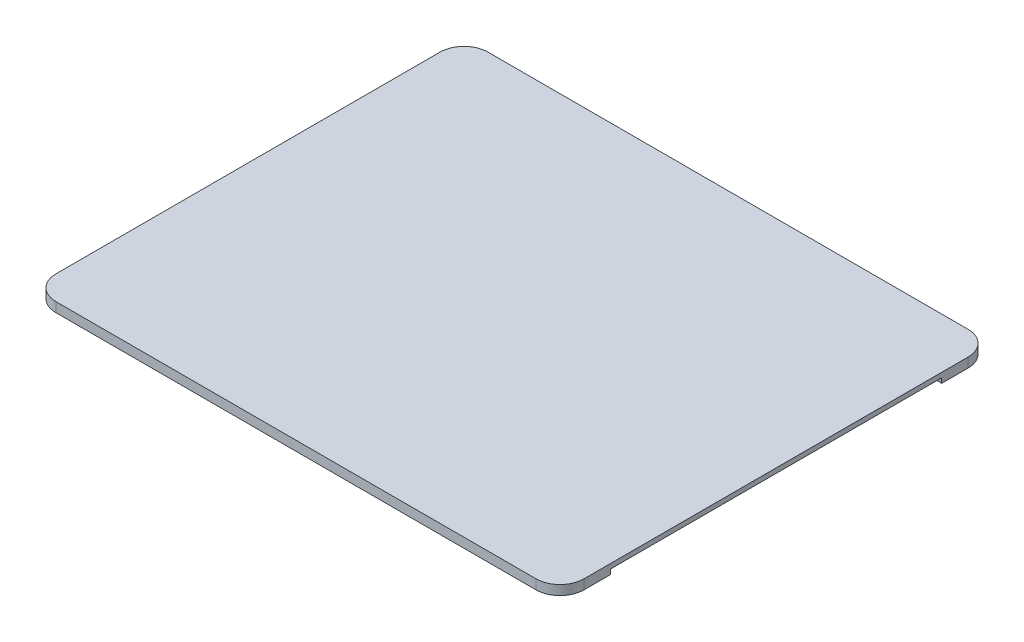
ISO-10303-21;
HEADER;
FILE_DESCRIPTION(('STEP AP214'),'2;1');
FILE_NAME('part.step','',(''),(''),'','','');
FILE_SCHEMA(('AUTOMOTIVE_DESIGN { 1 0 10303 214 1 1 1 1 }'));
ENDSEC;
DATA;
#1=APPLICATION_CONTEXT('core data for automotive mechanical design processes');
#2=APPLICATION_PROTOCOL_DEFINITION('international standard','automotive_design',2000,#1);
#3=PRODUCT_CONTEXT('',#1,'mechanical');
#4=PRODUCT('Part','Part','',(#3));
#5=PRODUCT_RELATED_PRODUCT_CATEGORY('part','',(#4));
#6=PRODUCT_DEFINITION_FORMATION('','',#4);
#7=PRODUCT_DEFINITION_CONTEXT('part definition',#1,'design');
#8=PRODUCT_DEFINITION('design','',#6,#7);
#9=PRODUCT_DEFINITION_SHAPE('','',#8);
#10=(LENGTH_UNIT() NAMED_UNIT(*) SI_UNIT(.MILLI.,.METRE.));
#11=(NAMED_UNIT(*) PLANE_ANGLE_UNIT() SI_UNIT($,.RADIAN.));
#12=(NAMED_UNIT(*) SI_UNIT($,.STERADIAN.) SOLID_ANGLE_UNIT());
#13=UNCERTAINTY_MEASURE_WITH_UNIT(LENGTH_MEASURE(1.E-05),#10,'distance_accuracy_value','');
#14=(GEOMETRIC_REPRESENTATION_CONTEXT(3) GLOBAL_UNCERTAINTY_ASSIGNED_CONTEXT((#13)) GLOBAL_UNIT_ASSIGNED_CONTEXT((#10,
#11,#12)) REPRESENTATION_CONTEXT('',''));
#15=CARTESIAN_POINT('',(0.,0.,0.));
#16=DIRECTION('',(0.,0.,1.));
#17=DIRECTION('',(1.,0.,0.));
#18=AXIS2_PLACEMENT_3D('',#15,#16,#17);
#19=CARTESIAN_POINT('',(-55.,5.,-45.));
#20=DIRECTION('',(1.,0.,0.));
#21=DIRECTION('',(0.,0.,-1.));
#22=AXIS2_PLACEMENT_3D('',#19,#20,#21);
#23=PLANE('',#22);
#24=DIRECTION('',(0.,-1.,0.));
#25=VECTOR('',#24,1.);
#26=CARTESIAN_POINT('',(-55.,3.,34.5));
#27=LINE('',#26,#25);
#28=CARTESIAN_POINT('',(-55.,4.,34.5));
#29=VERTEX_POINT('',#28);
#30=CARTESIAN_POINT('',(-55.,3.,34.5));
#31=VERTEX_POINT('',#30);
#32=EDGE_CURVE('E241',#29,#31,#27,.T.);
#33=ORIENTED_EDGE('',*,*,#32,.T.);
#34=DIRECTION('',(0.,0.,1.));
#35=VECTOR('',#34,1.);
#36=CARTESIAN_POINT('',(-55.,3.,-45.));
#37=LINE('',#36,#35);
#38=CARTESIAN_POINT('',(-55.,3.,40.));
#39=VERTEX_POINT('',#38);
#40=EDGE_CURVE('E336',#31,#39,#37,.T.);
#41=ORIENTED_EDGE('',*,*,#40,.T.);
#42=DIRECTION('',(0.,-1.,0.));
#43=VECTOR('',#42,1.);
#44=CARTESIAN_POINT('',(-55.,5.,40.));
#45=LINE('',#44,#43);
#46=CARTESIAN_POINT('',(-55.,5.,40.));
#47=VERTEX_POINT('',#46);
#48=EDGE_CURVE('E455',#39,#47,#45,.F.);
#49=ORIENTED_EDGE('',*,*,#48,.T.);
#50=DIRECTION('',(0.,0.,1.));
#51=VECTOR('',#50,1.);
#52=CARTESIAN_POINT('',(-55.,5.,-45.));
#53=LINE('',#52,#51);
#54=CARTESIAN_POINT('',(-55.,5.,-40.));
#55=VERTEX_POINT('',#54);
#56=EDGE_CURVE('E319',#55,#47,#53,.T.);
#57=ORIENTED_EDGE('',*,*,#56,.F.);
#58=DIRECTION('',(0.,-1.,0.));
#59=VECTOR('',#58,1.);
#60=CARTESIAN_POINT('',(-55.,5.,-40.));
#61=LINE('',#60,#59);
#62=CARTESIAN_POINT('',(-55.,3.,-40.));
#63=VERTEX_POINT('',#62);
#64=EDGE_CURVE('E486',#55,#63,#61,.T.);
#65=ORIENTED_EDGE('',*,*,#64,.T.);
#66=CARTESIAN_POINT('',(-55.,3.,-34.5));
#67=VERTEX_POINT('',#66);
#68=EDGE_CURVE('E337',#63,#67,#37,.T.);
#69=ORIENTED_EDGE('',*,*,#68,.T.);
#70=DIRECTION('',(0.,1.,0.));
#71=VECTOR('',#70,1.);
#72=CARTESIAN_POINT('',(-55.,3.,-34.5));
#73=LINE('',#72,#71);
#74=CARTESIAN_POINT('',(-55.,4.,-34.5));
#75=VERTEX_POINT('',#74);
#76=EDGE_CURVE('E249',#67,#75,#73,.T.);
#77=ORIENTED_EDGE('',*,*,#76,.T.);
#78=DIRECTION('',(0.,0.,1.));
#79=VECTOR('',#78,1.);
#80=CARTESIAN_POINT('',(-55.,4.,34.5));
#81=LINE('',#80,#79);
#82=EDGE_CURVE('E253',#75,#29,#81,.T.);
#83=ORIENTED_EDGE('',*,*,#82,.T.);
#84=EDGE_LOOP('',(#33,#41,#49,#57,#65,#69,#77,#83));
#85=FACE_BOUND('',#84,.T.);
#86=ADVANCED_FACE('F39',(#85),#23,.F.);
#87=CARTESIAN_POINT('',(0.,3.,0.));
#88=DIRECTION('',(0.,1.,0.));
#89=DIRECTION('',(0.,0.,1.));
#90=AXIS2_PLACEMENT_3D('',#87,#88,#89);
#91=PLANE('',#90);
#92=CARTESIAN_POINT('',(44.5,3.,34.5));
#93=DIRECTION('',(0.,1.,0.));
#94=DIRECTION('',(0.,0.,1.));
#95=AXIS2_PLACEMENT_3D('',#92,#93,#94);
#96=CIRCLE('',#95,5.);
#97=CARTESIAN_POINT('',(44.5,3.,39.5));
#98=VERTEX_POINT('',#97);
#99=CARTESIAN_POINT('',(49.5,3.,34.5));
#100=VERTEX_POINT('',#99);
#101=EDGE_CURVE('E375',#98,#100,#96,.T.);
#102=ORIENTED_EDGE('',*,*,#101,.T.);
#103=DIRECTION('',(0.,0.,-1.));
#104=VECTOR('',#103,1.);
#105=CARTESIAN_POINT('',(49.5,3.,-39.5));
#106=LINE('',#105,#104);
#107=CARTESIAN_POINT('',(49.5,3.,-34.5));
#108=VERTEX_POINT('',#107);
#109=EDGE_CURVE('E344',#100,#108,#106,.T.);
#110=ORIENTED_EDGE('',*,*,#109,.T.);
#111=CARTESIAN_POINT('',(44.5,3.,-34.5));
#112=DIRECTION('',(0.,1.,0.));
#113=DIRECTION('',(0.,0.,1.));
#114=AXIS2_PLACEMENT_3D('',#111,#112,#113);
#115=CIRCLE('',#114,5.);
#116=CARTESIAN_POINT('',(44.5,3.,-39.5));
#117=VERTEX_POINT('',#116);
#118=EDGE_CURVE('E387',#108,#117,#115,.T.);
#119=ORIENTED_EDGE('',*,*,#118,.T.);
#120=DIRECTION('',(-1.,0.,0.));
#121=VECTOR('',#120,1.);
#122=CARTESIAN_POINT('',(-49.5,3.,-39.5));
#123=LINE('',#122,#121);
#124=CARTESIAN_POINT('',(-44.5,3.,-39.5));
#125=VERTEX_POINT('',#124);
#126=EDGE_CURVE('E348',#117,#125,#123,.T.);
#127=ORIENTED_EDGE('',*,*,#126,.T.);
#128=CARTESIAN_POINT('',(-44.5,3.,-34.5));
#129=DIRECTION('',(0.,1.,0.));
#130=DIRECTION('',(0.,0.,1.));
#131=AXIS2_PLACEMENT_3D('',#128,#129,#130);
#132=CIRCLE('',#131,5.);
#133=CARTESIAN_POINT('',(-49.5,3.,-34.5));
#134=VERTEX_POINT('',#133);
#135=EDGE_CURVE('E383',#125,#134,#132,.T.);
#136=ORIENTED_EDGE('',*,*,#135,.T.);
#137=DIRECTION('',(0.,0.,1.));
#138=VECTOR('',#137,1.);
#139=CARTESIAN_POINT('',(-49.5,3.,-39.5));
#140=LINE('',#139,#138);
#141=CARTESIAN_POINT('',(-49.5,3.,34.5));
#142=VERTEX_POINT('',#141);
#143=EDGE_CURVE('E353',#134,#142,#140,.T.);
#144=ORIENTED_EDGE('',*,*,#143,.T.);
#145=CARTESIAN_POINT('',(-44.5,3.,34.5));
#146=DIRECTION('',(0.,1.,0.));
#147=DIRECTION('',(0.,0.,1.));
#148=AXIS2_PLACEMENT_3D('',#145,#146,#147);
#149=CIRCLE('',#148,5.);
#150=CARTESIAN_POINT('',(-44.5,3.,39.5));
#151=VERTEX_POINT('',#150);
#152=EDGE_CURVE('E379',#142,#151,#149,.T.);
#153=ORIENTED_EDGE('',*,*,#152,.T.);
#154=DIRECTION('',(1.,0.,0.));
#155=VECTOR('',#154,1.);
#156=CARTESIAN_POINT('',(-49.5,3.,39.5));
#157=LINE('',#156,#155);
#158=EDGE_CURVE('E357',#151,#98,#157,.T.);
#159=ORIENTED_EDGE('',*,*,#158,.T.);
#160=EDGE_LOOP('',(#102,#110,#119,#127,#136,#144,#153,#159));
#161=FACE_BOUND('',#160,.T.);
#162=DIRECTION('',(-1.,0.,0.));
#163=VECTOR('',#162,1.);
#164=CARTESIAN_POINT('',(-52.,3.,34.5));
#165=LINE('',#164,#163);
#166=CARTESIAN_POINT('',(-52.,3.,34.5));
#167=VERTEX_POINT('',#166);
#168=EDGE_CURVE('E264',#167,#31,#165,.T.);
#169=ORIENTED_EDGE('',*,*,#168,.F.);
#170=DIRECTION('',(0.,0.,-1.));
#171=VECTOR('',#170,1.);
#172=CARTESIAN_POINT('',(-52.,3.,34.5));
#173=LINE('',#172,#171);
#174=CARTESIAN_POINT('',(-52.,3.,-34.5));
#175=VERTEX_POINT('',#174);
#176=EDGE_CURVE('E244',#167,#175,#173,.T.);
#177=ORIENTED_EDGE('',*,*,#176,.T.);
#178=DIRECTION('',(-1.,0.,0.));
#179=VECTOR('',#178,1.);
#180=CARTESIAN_POINT('',(-52.,3.,-34.5));
#181=LINE('',#180,#179);
#182=EDGE_CURVE('E268',#175,#67,#181,.T.);
#183=ORIENTED_EDGE('',*,*,#182,.T.);
#184=ORIENTED_EDGE('',*,*,#68,.F.);
#185=CARTESIAN_POINT('',(-50.,3.,-40.));
#186=DIRECTION('',(0.,1.,0.));
#187=DIRECTION('',(0.,0.,1.));
#188=AXIS2_PLACEMENT_3D('',#185,#186,#187);
#189=CIRCLE('',#188,5.);
#190=CARTESIAN_POINT('',(-50.,3.,-45.));
#191=VERTEX_POINT('',#190);
#192=EDGE_CURVE('E501',#63,#191,#189,.F.);
#193=ORIENTED_EDGE('',*,*,#192,.T.);
#194=DIRECTION('',(-1.,0.,0.));
#195=VECTOR('',#194,1.);
#196=CARTESIAN_POINT('',(-55.,3.,-45.));
#197=LINE('',#196,#195);
#198=CARTESIAN_POINT('',(50.,3.,-45.));
#199=VERTEX_POINT('',#198);
#200=EDGE_CURVE('E332',#199,#191,#197,.T.);
#201=ORIENTED_EDGE('',*,*,#200,.F.);
#202=CARTESIAN_POINT('',(50.,3.,-40.));
#203=DIRECTION('',(0.,1.,0.));
#204=DIRECTION('',(0.,0.,1.));
#205=AXIS2_PLACEMENT_3D('',#202,#203,#204);
#206=CIRCLE('',#205,5.);
#207=CARTESIAN_POINT('',(55.,3.,-40.));
#208=VERTEX_POINT('',#207);
#209=EDGE_CURVE('E493',#199,#208,#206,.F.);
#210=ORIENTED_EDGE('',*,*,#209,.T.);
#211=DIRECTION('',(0.,0.,-1.));
#212=VECTOR('',#211,1.);
#213=CARTESIAN_POINT('',(55.,3.,-45.));
#214=LINE('',#213,#212);
#215=CARTESIAN_POINT('',(55.,3.,-34.5));
#216=VERTEX_POINT('',#215);
#217=EDGE_CURVE('E300',#216,#208,#214,.T.);
#218=ORIENTED_EDGE('',*,*,#217,.F.);
#219=DIRECTION('',(1.,0.,0.));
#220=VECTOR('',#219,1.);
#221=CARTESIAN_POINT('',(52.,3.,-34.5));
#222=LINE('',#221,#220);
#223=CARTESIAN_POINT('',(52.,3.,-34.5));
#224=VERTEX_POINT('',#223);
#225=EDGE_CURVE('E304',#224,#216,#222,.T.);
#226=ORIENTED_EDGE('',*,*,#225,.F.);
#227=DIRECTION('',(0.,0.,-1.));
#228=VECTOR('',#227,1.);
#229=CARTESIAN_POINT('',(52.,3.,34.5));
#230=LINE('',#229,#228);
#231=CARTESIAN_POINT('',(52.,3.,34.5));
#232=VERTEX_POINT('',#231);
#233=EDGE_CURVE('E276',#232,#224,#230,.T.);
#234=ORIENTED_EDGE('',*,*,#233,.F.);
#235=DIRECTION('',(1.,0.,0.));
#236=VECTOR('',#235,1.);
#237=CARTESIAN_POINT('',(52.,3.,34.5));
#238=LINE('',#237,#236);
#239=CARTESIAN_POINT('',(55.,3.,34.5));
#240=VERTEX_POINT('',#239);
#241=EDGE_CURVE('E287',#232,#240,#238,.T.);
#242=ORIENTED_EDGE('',*,*,#241,.T.);
#243=CARTESIAN_POINT('',(55.,3.,40.));
#244=VERTEX_POINT('',#243);
#245=EDGE_CURVE('E328',#244,#240,#214,.T.);
#246=ORIENTED_EDGE('',*,*,#245,.F.);
#247=CARTESIAN_POINT('',(50.,3.,40.));
#248=DIRECTION('',(0.,1.,0.));
#249=DIRECTION('',(0.,0.,1.));
#250=AXIS2_PLACEMENT_3D('',#247,#248,#249);
#251=CIRCLE('',#250,5.);
#252=CARTESIAN_POINT('',(50.,3.,45.));
#253=VERTEX_POINT('',#252);
#254=EDGE_CURVE('E490',#244,#253,#251,.F.);
#255=ORIENTED_EDGE('',*,*,#254,.T.);
#256=DIRECTION('',(1.,0.,0.));
#257=VECTOR('',#256,1.);
#258=CARTESIAN_POINT('',(-55.,3.,45.));
#259=LINE('',#258,#257);
#260=CARTESIAN_POINT('',(-50.,3.,45.));
#261=VERTEX_POINT('',#260);
#262=EDGE_CURVE('E315',#261,#253,#259,.T.);
#263=ORIENTED_EDGE('',*,*,#262,.F.);
#264=CARTESIAN_POINT('',(-50.,3.,40.));
#265=DIRECTION('',(0.,1.,0.));
#266=DIRECTION('',(0.,0.,1.));
#267=AXIS2_PLACEMENT_3D('',#264,#265,#266);
#268=CIRCLE('',#267,5.);
#269=EDGE_CURVE('E497',#261,#39,#268,.F.);
#270=ORIENTED_EDGE('',*,*,#269,.T.);
#271=ORIENTED_EDGE('',*,*,#40,.F.);
#272=EDGE_LOOP('',(#169,#177,#183,#184,#193,#201,#210,#218,#226,#234,#242,#246,#255,#263,#270,#271));
#273=FACE_BOUND('',#272,.T.);
#274=ADVANCED_FACE('F540',(#161,#273),#91,.F.);
#275=CARTESIAN_POINT('',(49.5,3.,-39.5));
#276=DIRECTION('',(-1.,0.,0.));
#277=DIRECTION('',(0.,0.,1.));
#278=AXIS2_PLACEMENT_3D('',#275,#276,#277);
#279=PLANE('',#278);
#280=DIRECTION('',(0.,-1.,0.));
#281=VECTOR('',#280,1.);
#282=CARTESIAN_POINT('',(49.5,3.,34.5));
#283=LINE('',#282,#281);
#284=CARTESIAN_POINT('',(49.5,1.,34.5));
#285=VERTEX_POINT('',#284);
#286=EDGE_CURVE('E368',#100,#285,#283,.T.);
#287=ORIENTED_EDGE('',*,*,#286,.T.);
#288=DIRECTION('',(0.,0.,-1.));
#289=VECTOR('',#288,1.);
#290=CARTESIAN_POINT('',(49.5,1.,-39.5));
#291=LINE('',#290,#289);
#292=CARTESIAN_POINT('',(49.5,1.,-34.5));
#293=VERTEX_POINT('',#292);
#294=EDGE_CURVE('E446',#285,#293,#291,.T.);
#295=ORIENTED_EDGE('',*,*,#294,.T.);
#296=DIRECTION('',(0.,-1.,0.));
#297=VECTOR('',#296,1.);
#298=CARTESIAN_POINT('',(49.5,3.,-34.5));
#299=LINE('',#298,#297);
#300=EDGE_CURVE('E372',#293,#108,#299,.F.);
#301=ORIENTED_EDGE('',*,*,#300,.T.);
#302=ORIENTED_EDGE('',*,*,#109,.F.);
#303=EDGE_LOOP('',(#287,#295,#301,#302));
#304=FACE_BOUND('',#303,.T.);
#305=ADVANCED_FACE('F602',(#304),#279,.F.);
#306=CARTESIAN_POINT('',(-49.5,3.,-39.5));
#307=DIRECTION('',(0.,0.,1.));
#308=DIRECTION('',(1.,0.,0.));
#309=AXIS2_PLACEMENT_3D('',#306,#307,#308);
#310=PLANE('',#309);
#311=DIRECTION('',(0.,-1.,0.));
#312=VECTOR('',#311,1.);
#313=CARTESIAN_POINT('',(44.5,3.,-39.5));
#314=LINE('',#313,#312);
#315=CARTESIAN_POINT('',(44.5,1.,-39.5));
#316=VERTEX_POINT('',#315);
#317=EDGE_CURVE('E364',#117,#316,#314,.T.);
#318=ORIENTED_EDGE('',*,*,#317,.T.);
#319=DIRECTION('',(-1.,0.,0.));
#320=VECTOR('',#319,1.);
#321=CARTESIAN_POINT('',(-49.5,1.,-39.5));
#322=LINE('',#321,#320);
#323=CARTESIAN_POINT('',(-44.5,1.,-39.5));
#324=VERTEX_POINT('',#323);
#325=EDGE_CURVE('E452',#316,#324,#322,.T.);
#326=ORIENTED_EDGE('',*,*,#325,.T.);
#327=DIRECTION('',(0.,-1.,0.));
#328=VECTOR('',#327,1.);
#329=CARTESIAN_POINT('',(-44.5,3.,-39.5));
#330=LINE('',#329,#328);
#331=EDGE_CURVE('E361',#324,#125,#330,.F.);
#332=ORIENTED_EDGE('',*,*,#331,.T.);
#333=ORIENTED_EDGE('',*,*,#126,.F.);
#334=EDGE_LOOP('',(#318,#326,#332,#333));
#335=FACE_BOUND('',#334,.T.);
#336=ADVANCED_FACE('F624',(#335),#310,.F.);
#337=CARTESIAN_POINT('',(-49.5,3.,-39.5));
#338=DIRECTION('',(1.,0.,0.));
#339=DIRECTION('',(0.,0.,-1.));
#340=AXIS2_PLACEMENT_3D('',#337,#338,#339);
#341=PLANE('',#340);
#342=DIRECTION('',(0.,-1.,0.));
#343=VECTOR('',#342,1.);
#344=CARTESIAN_POINT('',(-49.5,3.,-34.5));
#345=LINE('',#344,#343);
#346=CARTESIAN_POINT('',(-49.5,1.,-34.5));
#347=VERTEX_POINT('',#346);
#348=EDGE_CURVE('E394',#134,#347,#345,.T.);
#349=ORIENTED_EDGE('',*,*,#348,.T.);
#350=DIRECTION('',(0.,0.,1.));
#351=VECTOR('',#350,1.);
#352=CARTESIAN_POINT('',(-49.5,1.,-39.5));
#353=LINE('',#352,#351);
#354=CARTESIAN_POINT('',(-49.5,1.,34.5));
#355=VERTEX_POINT('',#354);
#356=EDGE_CURVE('E434',#347,#355,#353,.T.);
#357=ORIENTED_EDGE('',*,*,#356,.T.);
#358=DIRECTION('',(0.,-1.,0.));
#359=VECTOR('',#358,1.);
#360=CARTESIAN_POINT('',(-49.5,3.,34.5));
#361=LINE('',#360,#359);
#362=EDGE_CURVE('E391',#355,#142,#361,.F.);
#363=ORIENTED_EDGE('',*,*,#362,.T.);
#364=ORIENTED_EDGE('',*,*,#143,.F.);
#365=EDGE_LOOP('',(#349,#357,#363,#364));
#366=FACE_BOUND('',#365,.T.);
#367=ADVANCED_FACE('F620',(#366),#341,.F.);
#368=CARTESIAN_POINT('',(-49.5,3.,39.5));
#369=DIRECTION('',(0.,0.,-1.));
#370=DIRECTION('',(-1.,0.,0.));
#371=AXIS2_PLACEMENT_3D('',#368,#369,#370);
#372=PLANE('',#371);
#373=DIRECTION('',(0.,-1.,0.));
#374=VECTOR('',#373,1.);
#375=CARTESIAN_POINT('',(-44.5,3.,39.5));
#376=LINE('',#375,#374);
#377=CARTESIAN_POINT('',(-44.5,1.,39.5));
#378=VERTEX_POINT('',#377);
#379=EDGE_CURVE('E401',#151,#378,#376,.T.);
#380=ORIENTED_EDGE('',*,*,#379,.T.);
#381=DIRECTION('',(1.,0.,0.));
#382=VECTOR('',#381,1.);
#383=CARTESIAN_POINT('',(-49.5,1.,39.5));
#384=LINE('',#383,#382);
#385=CARTESIAN_POINT('',(44.5,1.,39.5));
#386=VERTEX_POINT('',#385);
#387=EDGE_CURVE('E440',#378,#386,#384,.T.);
#388=ORIENTED_EDGE('',*,*,#387,.T.);
#389=DIRECTION('',(0.,-1.,0.));
#390=VECTOR('',#389,1.);
#391=CARTESIAN_POINT('',(44.5,3.,39.5));
#392=LINE('',#391,#390);
#393=EDGE_CURVE('E398',#386,#98,#392,.F.);
#394=ORIENTED_EDGE('',*,*,#393,.T.);
#395=ORIENTED_EDGE('',*,*,#158,.F.);
#396=EDGE_LOOP('',(#380,#388,#394,#395));
#397=FACE_BOUND('',#396,.T.);
#398=ADVANCED_FACE('F616',(#397),#372,.F.);
#399=CARTESIAN_POINT('',(0.,0.,0.));
#400=DIRECTION('',(0.,1.,0.));
#401=DIRECTION('',(0.,0.,1.));
#402=AXIS2_PLACEMENT_3D('',#399,#400,#401);
#403=PLANE('',#402);
#404=DIRECTION('',(1.,0.,0.));
#405=VECTOR('',#404,1.);
#406=CARTESIAN_POINT('',(0.,0.,38.5));
#407=LINE('',#406,#405);
#408=CARTESIAN_POINT('',(44.5,0.,38.5));
#409=VERTEX_POINT('',#408);
#410=CARTESIAN_POINT('',(-44.5,0.,38.5));
#411=VERTEX_POINT('',#410);
#412=EDGE_CURVE('E417',#409,#411,#407,.F.);
#413=ORIENTED_EDGE('',*,*,#412,.T.);
#414=CARTESIAN_POINT('',(-44.5,0.,34.5));
#415=DIRECTION('',(0.,1.,0.));
#416=DIRECTION('',(0.,0.,1.));
#417=AXIS2_PLACEMENT_3D('',#414,#415,#416);
#418=CIRCLE('',#417,4.);
#419=CARTESIAN_POINT('',(-48.5,0.,34.5));
#420=VERTEX_POINT('',#419);
#421=EDGE_CURVE('E426',#411,#420,#418,.F.);
#422=ORIENTED_EDGE('',*,*,#421,.T.);
#423=DIRECTION('',(0.,0.,1.));
#424=VECTOR('',#423,1.);
#425=CARTESIAN_POINT('',(-48.5,0.,0.));
#426=LINE('',#425,#424);
#427=CARTESIAN_POINT('',(-48.5,0.,-34.5));
#428=VERTEX_POINT('',#427);
#429=EDGE_CURVE('E423',#420,#428,#426,.F.);
#430=ORIENTED_EDGE('',*,*,#429,.T.);
#431=CARTESIAN_POINT('',(-44.5,0.,-34.5));
#432=DIRECTION('',(0.,1.,0.));
#433=DIRECTION('',(0.,0.,1.));
#434=AXIS2_PLACEMENT_3D('',#431,#432,#433);
#435=CIRCLE('',#434,4.);
#436=CARTESIAN_POINT('',(-44.5,0.,-38.5));
#437=VERTEX_POINT('',#436);
#438=EDGE_CURVE('E420',#428,#437,#435,.F.);
#439=ORIENTED_EDGE('',*,*,#438,.T.);
#440=DIRECTION('',(-1.,0.,0.));
#441=VECTOR('',#440,1.);
#442=CARTESIAN_POINT('',(0.,0.,-38.5));
#443=LINE('',#442,#441);
#444=CARTESIAN_POINT('',(44.5,0.,-38.5));
#445=VERTEX_POINT('',#444);
#446=EDGE_CURVE('E405',#437,#445,#443,.F.);
#447=ORIENTED_EDGE('',*,*,#446,.T.);
#448=CARTESIAN_POINT('',(44.5,0.,-34.5));
#449=DIRECTION('',(0.,1.,0.));
#450=DIRECTION('',(0.,0.,1.));
#451=AXIS2_PLACEMENT_3D('',#448,#449,#450);
#452=CIRCLE('',#451,4.);
#453=CARTESIAN_POINT('',(48.5,0.,-34.5));
#454=VERTEX_POINT('',#453);
#455=EDGE_CURVE('E408',#445,#454,#452,.F.);
#456=ORIENTED_EDGE('',*,*,#455,.T.);
#457=DIRECTION('',(0.,0.,-1.));
#458=VECTOR('',#457,1.);
#459=CARTESIAN_POINT('',(48.5,0.,0.));
#460=LINE('',#459,#458);
#461=CARTESIAN_POINT('',(48.5,0.,34.5));
#462=VERTEX_POINT('',#461);
#463=EDGE_CURVE('E411',#454,#462,#460,.F.);
#464=ORIENTED_EDGE('',*,*,#463,.T.);
#465=CARTESIAN_POINT('',(44.5,0.,34.5));
#466=DIRECTION('',(0.,1.,0.));
#467=DIRECTION('',(0.,0.,1.));
#468=AXIS2_PLACEMENT_3D('',#465,#466,#467);
#469=CIRCLE('',#468,4.);
#470=EDGE_CURVE('E414',#462,#409,#469,.F.);
#471=ORIENTED_EDGE('',*,*,#470,.T.);
#472=EDGE_LOOP('',(#413,#422,#430,#439,#447,#456,#464,#471));
#473=FACE_BOUND('',#472,.T.);
#474=ADVANCED_FACE('F612',(#473),#403,.F.);
#475=CARTESIAN_POINT('',(44.5,3.,-34.5));
#476=DIRECTION('',(0.,-1.,0.));
#477=DIRECTION('',(0.,0.,-1.));
#478=AXIS2_PLACEMENT_3D('',#475,#476,#477);
#479=CYLINDRICAL_SURFACE('',#478,5.);
#480=ORIENTED_EDGE('',*,*,#300,.F.);
#481=CARTESIAN_POINT('',(44.5,1.,-34.5));
#482=DIRECTION('',(0.,1.,0.));
#483=DIRECTION('',(0.,0.,1.));
#484=AXIS2_PLACEMENT_3D('',#481,#482,#483);
#485=CIRCLE('',#484,5.);
#486=EDGE_CURVE('E449',#293,#316,#485,.T.);
#487=ORIENTED_EDGE('',*,*,#486,.T.);
#488=ORIENTED_EDGE('',*,*,#317,.F.);
#489=ORIENTED_EDGE('',*,*,#118,.F.);
#490=EDGE_LOOP('',(#480,#487,#488,#489));
#491=FACE_BOUND('',#490,.T.);
#492=ADVANCED_FACE('F615',(#491),#479,.T.);
#493=CARTESIAN_POINT('',(-44.5,3.,-34.5));
#494=DIRECTION('',(0.,-1.,0.));
#495=DIRECTION('',(0.,0.,-1.));
#496=AXIS2_PLACEMENT_3D('',#493,#494,#495);
#497=CYLINDRICAL_SURFACE('',#496,5.);
#498=ORIENTED_EDGE('',*,*,#331,.F.);
#499=CARTESIAN_POINT('',(-44.5,1.,-34.5));
#500=DIRECTION('',(0.,1.,0.));
#501=DIRECTION('',(0.,0.,1.));
#502=AXIS2_PLACEMENT_3D('',#499,#500,#501);
#503=CIRCLE('',#502,5.);
#504=EDGE_CURVE('E437',#324,#347,#503,.T.);
#505=ORIENTED_EDGE('',*,*,#504,.T.);
#506=ORIENTED_EDGE('',*,*,#348,.F.);
#507=ORIENTED_EDGE('',*,*,#135,.F.);
#508=EDGE_LOOP('',(#498,#505,#506,#507));
#509=FACE_BOUND('',#508,.T.);
#510=ADVANCED_FACE('F634',(#509),#497,.T.);
#511=CARTESIAN_POINT('',(-44.5,3.,34.5));
#512=DIRECTION('',(0.,-1.,0.));
#513=DIRECTION('',(0.,0.,-1.));
#514=AXIS2_PLACEMENT_3D('',#511,#512,#513);
#515=CYLINDRICAL_SURFACE('',#514,5.);
#516=ORIENTED_EDGE('',*,*,#362,.F.);
#517=CARTESIAN_POINT('',(-44.5,1.,34.5));
#518=DIRECTION('',(0.,1.,0.));
#519=DIRECTION('',(0.,0.,1.));
#520=AXIS2_PLACEMENT_3D('',#517,#518,#519);
#521=CIRCLE('',#520,5.);
#522=EDGE_CURVE('E430',#355,#378,#521,.T.);
#523=ORIENTED_EDGE('',*,*,#522,.T.);
#524=ORIENTED_EDGE('',*,*,#379,.F.);
#525=ORIENTED_EDGE('',*,*,#152,.F.);
#526=EDGE_LOOP('',(#516,#523,#524,#525));
#527=FACE_BOUND('',#526,.T.);
#528=ADVANCED_FACE('F638',(#527),#515,.T.);
#529=CARTESIAN_POINT('',(44.5,3.,34.5));
#530=DIRECTION('',(0.,-1.,0.));
#531=DIRECTION('',(0.,0.,-1.));
#532=AXIS2_PLACEMENT_3D('',#529,#530,#531);
#533=CYLINDRICAL_SURFACE('',#532,5.);
#534=ORIENTED_EDGE('',*,*,#393,.F.);
#535=CARTESIAN_POINT('',(44.5,1.,34.5));
#536=DIRECTION('',(0.,1.,0.));
#537=DIRECTION('',(0.,0.,1.));
#538=AXIS2_PLACEMENT_3D('',#535,#536,#537);
#539=CIRCLE('',#538,5.);
#540=EDGE_CURVE('E443',#386,#285,#539,.T.);
#541=ORIENTED_EDGE('',*,*,#540,.T.);
#542=ORIENTED_EDGE('',*,*,#286,.F.);
#543=ORIENTED_EDGE('',*,*,#101,.F.);
#544=EDGE_LOOP('',(#534,#541,#542,#543));
#545=FACE_BOUND('',#544,.T.);
#546=ADVANCED_FACE('F642',(#545),#533,.T.);
#547=CARTESIAN_POINT('',(44.5,1.,-34.5));
#548=DIRECTION('',(0.,1.,0.));
#549=DIRECTION('',(0.,0.,1.));
#550=AXIS2_PLACEMENT_3D('',#547,#548,#549);
#551=TOROIDAL_SURFACE('',#550,4.,1.);
#552=CARTESIAN_POINT('',(44.5,1.,-38.5));
#553=DIRECTION('',(-1.,0.,0.));
#554=DIRECTION('',(0.,0.,1.));
#555=AXIS2_PLACEMENT_3D('',#552,#553,#554);
#556=CIRCLE('',#555,1.);
#557=EDGE_CURVE('E477',#316,#445,#556,.T.);
#558=ORIENTED_EDGE('',*,*,#557,.F.);
#559=ORIENTED_EDGE('',*,*,#486,.F.);
#560=CARTESIAN_POINT('',(48.5,1.,-34.5));
#561=DIRECTION('',(0.,0.,1.));
#562=DIRECTION('',(1.,0.,0.));
#563=AXIS2_PLACEMENT_3D('',#560,#561,#562);
#564=CIRCLE('',#563,1.);
#565=EDGE_CURVE('E349',#454,#293,#564,.T.);
#566=ORIENTED_EDGE('',*,*,#565,.F.);
#567=ORIENTED_EDGE('',*,*,#455,.F.);
#568=EDGE_LOOP('',(#558,#559,#566,#567));
#569=FACE_BOUND('',#568,.T.);
#570=ADVANCED_FACE('F646',(#569),#551,.T.);
#571=CARTESIAN_POINT('',(48.5,1.,-39.5));
#572=DIRECTION('',(0.,0.,-1.));
#573=DIRECTION('',(-1.,0.,0.));
#574=AXIS2_PLACEMENT_3D('',#571,#572,#573);
#575=CYLINDRICAL_SURFACE('',#574,1.);
#576=ORIENTED_EDGE('',*,*,#565,.T.);
#577=ORIENTED_EDGE('',*,*,#294,.F.);
#578=CARTESIAN_POINT('',(48.5,1.,34.5));
#579=DIRECTION('',(0.,0.,1.));
#580=DIRECTION('',(1.,0.,0.));
#581=AXIS2_PLACEMENT_3D('',#578,#579,#580);
#582=CIRCLE('',#581,1.);
#583=EDGE_CURVE('E473',#462,#285,#582,.T.);
#584=ORIENTED_EDGE('',*,*,#583,.F.);
#585=ORIENTED_EDGE('',*,*,#463,.F.);
#586=EDGE_LOOP('',(#576,#577,#584,#585));
#587=FACE_BOUND('',#586,.T.);
#588=ADVANCED_FACE('F670',(#587),#575,.T.);
#589=CARTESIAN_POINT('',(-49.5,1.,-38.5));
#590=DIRECTION('',(-1.,0.,0.));
#591=DIRECTION('',(0.,0.,1.));
#592=AXIS2_PLACEMENT_3D('',#589,#590,#591);
#593=CYLINDRICAL_SURFACE('',#592,1.);
#594=ORIENTED_EDGE('',*,*,#557,.T.);
#595=ORIENTED_EDGE('',*,*,#446,.F.);
#596=CARTESIAN_POINT('',(-44.5,1.,-38.5));
#597=DIRECTION('',(-1.,0.,0.));
#598=DIRECTION('',(0.,0.,1.));
#599=AXIS2_PLACEMENT_3D('',#596,#597,#598);
#600=CIRCLE('',#599,1.);
#601=EDGE_CURVE('E469',#324,#437,#600,.T.);
#602=ORIENTED_EDGE('',*,*,#601,.F.);
#603=ORIENTED_EDGE('',*,*,#325,.F.);
#604=EDGE_LOOP('',(#594,#595,#602,#603));
#605=FACE_BOUND('',#604,.T.);
#606=ADVANCED_FACE('F666',(#605),#593,.T.);
#607=CARTESIAN_POINT('',(44.5,1.,34.5));
#608=DIRECTION('',(0.,1.,0.));
#609=DIRECTION('',(0.,0.,1.));
#610=AXIS2_PLACEMENT_3D('',#607,#608,#609);
#611=TOROIDAL_SURFACE('',#610,4.,1.);
#612=ORIENTED_EDGE('',*,*,#583,.T.);
#613=ORIENTED_EDGE('',*,*,#540,.F.);
#614=CARTESIAN_POINT('',(44.5,1.,38.5));
#615=DIRECTION('',(-1.,0.,0.));
#616=DIRECTION('',(0.,0.,1.));
#617=AXIS2_PLACEMENT_3D('',#614,#615,#616);
#618=CIRCLE('',#617,1.);
#619=EDGE_CURVE('E465',#409,#386,#618,.T.);
#620=ORIENTED_EDGE('',*,*,#619,.F.);
#621=ORIENTED_EDGE('',*,*,#470,.F.);
#622=EDGE_LOOP('',(#612,#613,#620,#621));
#623=FACE_BOUND('',#622,.T.);
#624=ADVANCED_FACE('F662',(#623),#611,.T.);
#625=CARTESIAN_POINT('',(-44.5,1.,-34.5));
#626=DIRECTION('',(0.,1.,0.));
#627=DIRECTION('',(0.,0.,1.));
#628=AXIS2_PLACEMENT_3D('',#625,#626,#627);
#629=TOROIDAL_SURFACE('',#628,4.,1.);
#630=ORIENTED_EDGE('',*,*,#601,.T.);
#631=ORIENTED_EDGE('',*,*,#438,.F.);
#632=CARTESIAN_POINT('',(-48.5,1.,-34.5));
#633=DIRECTION('',(0.,0.,1.));
#634=DIRECTION('',(1.,0.,0.));
#635=AXIS2_PLACEMENT_3D('',#632,#633,#634);
#636=CIRCLE('',#635,1.);
#637=EDGE_CURVE('E461',#347,#428,#636,.T.);
#638=ORIENTED_EDGE('',*,*,#637,.F.);
#639=ORIENTED_EDGE('',*,*,#504,.F.);
#640=EDGE_LOOP('',(#630,#631,#638,#639));
#641=FACE_BOUND('',#640,.T.);
#642=ADVANCED_FACE('F658',(#641),#629,.T.);
#643=CARTESIAN_POINT('',(-49.5,1.,38.5));
#644=DIRECTION('',(1.,0.,0.));
#645=DIRECTION('',(0.,0.,-1.));
#646=AXIS2_PLACEMENT_3D('',#643,#644,#645);
#647=CYLINDRICAL_SURFACE('',#646,1.);
#648=ORIENTED_EDGE('',*,*,#619,.T.);
#649=ORIENTED_EDGE('',*,*,#387,.F.);
#650=CARTESIAN_POINT('',(-44.5,1.,38.5));
#651=DIRECTION('',(-1.,0.,0.));
#652=DIRECTION('',(0.,0.,1.));
#653=AXIS2_PLACEMENT_3D('',#650,#651,#652);
#654=CIRCLE('',#653,1.);
#655=EDGE_CURVE('E458',#411,#378,#654,.T.);
#656=ORIENTED_EDGE('',*,*,#655,.F.);
#657=ORIENTED_EDGE('',*,*,#412,.F.);
#658=EDGE_LOOP('',(#648,#649,#656,#657));
#659=FACE_BOUND('',#658,.T.);
#660=ADVANCED_FACE('F654',(#659),#647,.T.);
#661=CARTESIAN_POINT('',(-48.5,1.,-39.5));
#662=DIRECTION('',(0.,0.,1.));
#663=DIRECTION('',(1.,0.,0.));
#664=AXIS2_PLACEMENT_3D('',#661,#662,#663);
#665=CYLINDRICAL_SURFACE('',#664,1.);
#666=ORIENTED_EDGE('',*,*,#637,.T.);
#667=ORIENTED_EDGE('',*,*,#429,.F.);
#668=CARTESIAN_POINT('',(-48.5,1.,34.5));
#669=DIRECTION('',(0.,0.,1.));
#670=DIRECTION('',(1.,0.,0.));
#671=AXIS2_PLACEMENT_3D('',#668,#669,#670);
#672=CIRCLE('',#671,1.);
#673=EDGE_CURVE('E327',#355,#420,#672,.T.);
#674=ORIENTED_EDGE('',*,*,#673,.F.);
#675=ORIENTED_EDGE('',*,*,#356,.F.);
#676=EDGE_LOOP('',(#666,#667,#674,#675));
#677=FACE_BOUND('',#676,.T.);
#678=ADVANCED_FACE('F650',(#677),#665,.T.);
#679=CARTESIAN_POINT('',(-44.5,1.,34.5));
#680=DIRECTION('',(0.,1.,0.));
#681=DIRECTION('',(0.,0.,1.));
#682=AXIS2_PLACEMENT_3D('',#679,#680,#681);
#683=TOROIDAL_SURFACE('',#682,4.,1.);
#684=ORIENTED_EDGE('',*,*,#655,.T.);
#685=ORIENTED_EDGE('',*,*,#522,.F.);
#686=ORIENTED_EDGE('',*,*,#673,.T.);
#687=ORIENTED_EDGE('',*,*,#421,.F.);
#688=EDGE_LOOP('',(#684,#685,#686,#687));
#689=FACE_BOUND('',#688,.T.);
#690=ADVANCED_FACE('F611',(#689),#683,.T.);
#691=CARTESIAN_POINT('',(55.,5.,-45.));
#692=DIRECTION('',(-1.,0.,0.));
#693=DIRECTION('',(0.,0.,1.));
#694=AXIS2_PLACEMENT_3D('',#691,#692,#693);
#695=PLANE('',#694);
#696=ORIENTED_EDGE('',*,*,#245,.T.);
#697=DIRECTION('',(0.,-1.,0.));
#698=VECTOR('',#697,1.);
#699=CARTESIAN_POINT('',(55.,3.,34.5));
#700=LINE('',#699,#698);
#701=CARTESIAN_POINT('',(55.,4.,34.5));
#702=VERTEX_POINT('',#701);
#703=EDGE_CURVE('E267',#702,#240,#700,.T.);
#704=ORIENTED_EDGE('',*,*,#703,.F.);
#705=DIRECTION('',(0.,0.,1.));
#706=VECTOR('',#705,1.);
#707=CARTESIAN_POINT('',(55.,4.,34.5));
#708=LINE('',#707,#706);
#709=CARTESIAN_POINT('',(55.,4.,-34.5));
#710=VERTEX_POINT('',#709);
#711=EDGE_CURVE('E277',#710,#702,#708,.T.);
#712=ORIENTED_EDGE('',*,*,#711,.F.);
#713=DIRECTION('',(0.,1.,0.));
#714=VECTOR('',#713,1.);
#715=CARTESIAN_POINT('',(55.,3.,-34.5));
#716=LINE('',#715,#714);
#717=EDGE_CURVE('E290',#216,#710,#716,.T.);
#718=ORIENTED_EDGE('',*,*,#717,.F.);
#719=ORIENTED_EDGE('',*,*,#217,.T.);
#720=DIRECTION('',(0.,-1.,0.));
#721=VECTOR('',#720,1.);
#722=CARTESIAN_POINT('',(55.,5.,-40.));
#723=LINE('',#722,#721);
#724=CARTESIAN_POINT('',(55.,5.,-40.));
#725=VERTEX_POINT('',#724);
#726=EDGE_CURVE('E11',#208,#725,#723,.F.);
#727=ORIENTED_EDGE('',*,*,#726,.T.);
#728=DIRECTION('',(0.,0.,-1.));
#729=VECTOR('',#728,1.);
#730=CARTESIAN_POINT('',(55.,5.,-45.));
#731=LINE('',#730,#729);
#732=CARTESIAN_POINT('',(55.,5.,40.));
#733=VERTEX_POINT('',#732);
#734=EDGE_CURVE('E310',#733,#725,#731,.T.);
#735=ORIENTED_EDGE('',*,*,#734,.F.);
#736=DIRECTION('',(0.,-1.,0.));
#737=VECTOR('',#736,1.);
#738=CARTESIAN_POINT('',(55.,5.,40.));
#739=LINE('',#738,#737);
#740=EDGE_CURVE('E48',#733,#244,#739,.T.);
#741=ORIENTED_EDGE('',*,*,#740,.T.);
#742=EDGE_LOOP('',(#696,#704,#712,#718,#719,#727,#735,#741));
#743=FACE_BOUND('',#742,.T.);
#744=ADVANCED_FACE('F535',(#743),#695,.F.);
#745=CARTESIAN_POINT('',(-55.,5.,-45.));
#746=DIRECTION('',(0.,0.,1.));
#747=DIRECTION('',(1.,0.,0.));
#748=AXIS2_PLACEMENT_3D('',#745,#746,#747);
#749=PLANE('',#748);
#750=ORIENTED_EDGE('',*,*,#200,.T.);
#751=DIRECTION('',(0.,-1.,0.));
#752=VECTOR('',#751,1.);
#753=CARTESIAN_POINT('',(-50.,5.,-45.));
#754=LINE('',#753,#752);
#755=CARTESIAN_POINT('',(-50.,5.,-45.));
#756=VERTEX_POINT('',#755);
#757=EDGE_CURVE('E508',#191,#756,#754,.F.);
#758=ORIENTED_EDGE('',*,*,#757,.T.);
#759=DIRECTION('',(-1.,0.,0.));
#760=VECTOR('',#759,1.);
#761=CARTESIAN_POINT('',(-55.,5.,-45.));
#762=LINE('',#761,#760);
#763=CARTESIAN_POINT('',(50.,5.,-45.));
#764=VERTEX_POINT('',#763);
#765=EDGE_CURVE('E314',#764,#756,#762,.T.);
#766=ORIENTED_EDGE('',*,*,#765,.F.);
#767=DIRECTION('',(0.,-1.,0.));
#768=VECTOR('',#767,1.);
#769=CARTESIAN_POINT('',(50.,5.,-45.));
#770=LINE('',#769,#768);
#771=EDGE_CURVE('E504',#764,#199,#770,.T.);
#772=ORIENTED_EDGE('',*,*,#771,.T.);
#773=EDGE_LOOP('',(#750,#758,#766,#772));
#774=FACE_BOUND('',#773,.T.);
#775=ADVANCED_FACE('F578',(#774),#749,.F.);
#776=CARTESIAN_POINT('',(-55.,5.,45.));
#777=DIRECTION('',(0.,0.,-1.));
#778=DIRECTION('',(-1.,0.,0.));
#779=AXIS2_PLACEMENT_3D('',#776,#777,#778);
#780=PLANE('',#779);
#781=DIRECTION('',(1.,0.,0.));
#782=VECTOR('',#781,1.);
#783=CARTESIAN_POINT('',(-55.,5.,45.));
#784=LINE('',#783,#782);
#785=CARTESIAN_POINT('',(-50.,5.,45.));
#786=VERTEX_POINT('',#785);
#787=CARTESIAN_POINT('',(50.,5.,45.));
#788=VERTEX_POINT('',#787);
#789=EDGE_CURVE('E323',#786,#788,#784,.T.);
#790=ORIENTED_EDGE('',*,*,#789,.F.);
#791=DIRECTION('',(0.,-1.,0.));
#792=VECTOR('',#791,1.);
#793=CARTESIAN_POINT('',(-50.,5.,45.));
#794=LINE('',#793,#792);
#795=EDGE_CURVE('E526',#786,#261,#794,.T.);
#796=ORIENTED_EDGE('',*,*,#795,.T.);
#797=ORIENTED_EDGE('',*,*,#262,.T.);
#798=DIRECTION('',(0.,-1.,0.));
#799=VECTOR('',#798,1.);
#800=CARTESIAN_POINT('',(50.,5.,45.));
#801=LINE('',#800,#799);
#802=EDGE_CURVE('E523',#253,#788,#801,.F.);
#803=ORIENTED_EDGE('',*,*,#802,.T.);
#804=EDGE_LOOP('',(#790,#796,#797,#803));
#805=FACE_BOUND('',#804,.T.);
#806=ADVANCED_FACE('F570',(#805),#780,.F.);
#807=CARTESIAN_POINT('',(0.,5.,0.));
#808=DIRECTION('',(0.,1.,0.));
#809=DIRECTION('',(0.,0.,1.));
#810=AXIS2_PLACEMENT_3D('',#807,#808,#809);
#811=PLANE('',#810);
#812=ORIENTED_EDGE('',*,*,#765,.T.);
#813=CARTESIAN_POINT('',(-50.,5.,-40.));
#814=DIRECTION('',(0.,1.,0.));
#815=DIRECTION('',(0.,0.,1.));
#816=AXIS2_PLACEMENT_3D('',#813,#814,#815);
#817=CIRCLE('',#816,5.);
#818=EDGE_CURVE('E520',#756,#55,#817,.T.);
#819=ORIENTED_EDGE('',*,*,#818,.T.);
#820=ORIENTED_EDGE('',*,*,#56,.T.);
#821=CARTESIAN_POINT('',(-50.,5.,40.));
#822=DIRECTION('',(0.,1.,0.));
#823=DIRECTION('',(0.,0.,1.));
#824=AXIS2_PLACEMENT_3D('',#821,#822,#823);
#825=CIRCLE('',#824,5.);
#826=EDGE_CURVE('E517',#47,#786,#825,.T.);
#827=ORIENTED_EDGE('',*,*,#826,.T.);
#828=ORIENTED_EDGE('',*,*,#789,.T.);
#829=CARTESIAN_POINT('',(50.,5.,40.));
#830=DIRECTION('',(0.,1.,0.));
#831=DIRECTION('',(0.,0.,1.));
#832=AXIS2_PLACEMENT_3D('',#829,#830,#831);
#833=CIRCLE('',#832,5.);
#834=EDGE_CURVE('E511',#788,#733,#833,.T.);
#835=ORIENTED_EDGE('',*,*,#834,.T.);
#836=ORIENTED_EDGE('',*,*,#734,.T.);
#837=CARTESIAN_POINT('',(50.,5.,-40.));
#838=DIRECTION('',(0.,1.,0.));
#839=DIRECTION('',(0.,0.,1.));
#840=AXIS2_PLACEMENT_3D('',#837,#838,#839);
#841=CIRCLE('',#840,5.);
#842=EDGE_CURVE('E514',#725,#764,#841,.T.);
#843=ORIENTED_EDGE('',*,*,#842,.T.);
#844=EDGE_LOOP('',(#812,#819,#820,#827,#828,#835,#836,#843));
#845=FACE_BOUND('',#844,.T.);
#846=ADVANCED_FACE('F568',(#845),#811,.T.);
#847=CARTESIAN_POINT('',(-50.,5.,-40.));
#848=DIRECTION('',(0.,-1.,0.));
#849=DIRECTION('',(0.,0.,-1.));
#850=AXIS2_PLACEMENT_3D('',#847,#848,#849);
#851=CYLINDRICAL_SURFACE('',#850,5.);
#852=ORIENTED_EDGE('',*,*,#818,.F.);
#853=ORIENTED_EDGE('',*,*,#757,.F.);
#854=ORIENTED_EDGE('',*,*,#192,.F.);
#855=ORIENTED_EDGE('',*,*,#64,.F.);
#856=EDGE_LOOP('',(#852,#853,#854,#855));
#857=FACE_BOUND('',#856,.T.);
#858=ADVANCED_FACE('F584',(#857),#851,.T.);
#859=CARTESIAN_POINT('',(-50.,5.,40.));
#860=DIRECTION('',(0.,-1.,0.));
#861=DIRECTION('',(0.,0.,-1.));
#862=AXIS2_PLACEMENT_3D('',#859,#860,#861);
#863=CYLINDRICAL_SURFACE('',#862,5.);
#864=ORIENTED_EDGE('',*,*,#826,.F.);
#865=ORIENTED_EDGE('',*,*,#48,.F.);
#866=ORIENTED_EDGE('',*,*,#269,.F.);
#867=ORIENTED_EDGE('',*,*,#795,.F.);
#868=EDGE_LOOP('',(#864,#865,#866,#867));
#869=FACE_BOUND('',#868,.T.);
#870=ADVANCED_FACE('F565',(#869),#863,.T.);
#871=CARTESIAN_POINT('',(50.,5.,-40.));
#872=DIRECTION('',(0.,-1.,0.));
#873=DIRECTION('',(0.,0.,-1.));
#874=AXIS2_PLACEMENT_3D('',#871,#872,#873);
#875=CYLINDRICAL_SURFACE('',#874,5.);
#876=ORIENTED_EDGE('',*,*,#842,.F.);
#877=ORIENTED_EDGE('',*,*,#726,.F.);
#878=ORIENTED_EDGE('',*,*,#209,.F.);
#879=ORIENTED_EDGE('',*,*,#771,.F.);
#880=EDGE_LOOP('',(#876,#877,#878,#879));
#881=FACE_BOUND('',#880,.T.);
#882=ADVANCED_FACE('F576',(#881),#875,.T.);
#883=CARTESIAN_POINT('',(50.,5.,40.));
#884=DIRECTION('',(0.,-1.,0.));
#885=DIRECTION('',(0.,0.,-1.));
#886=AXIS2_PLACEMENT_3D('',#883,#884,#885);
#887=CYLINDRICAL_SURFACE('',#886,5.);
#888=ORIENTED_EDGE('',*,*,#834,.F.);
#889=ORIENTED_EDGE('',*,*,#802,.F.);
#890=ORIENTED_EDGE('',*,*,#254,.F.);
#891=ORIENTED_EDGE('',*,*,#740,.F.);
#892=EDGE_LOOP('',(#888,#889,#890,#891));
#893=FACE_BOUND('',#892,.T.);
#894=ADVANCED_FACE('F41',(#893),#887,.T.);
#895=CARTESIAN_POINT('',(52.,3.,34.5));
#896=DIRECTION('',(0.,0.,1.));
#897=DIRECTION('',(1.,0.,0.));
#898=AXIS2_PLACEMENT_3D('',#895,#896,#897);
#899=PLANE('',#898);
#900=ORIENTED_EDGE('',*,*,#703,.T.);
#901=ORIENTED_EDGE('',*,*,#241,.F.);
#902=DIRECTION('',(0.,-1.,0.));
#903=VECTOR('',#902,1.);
#904=CARTESIAN_POINT('',(52.,3.,34.5));
#905=LINE('',#904,#903);
#906=CARTESIAN_POINT('',(52.,4.,34.5));
#907=VERTEX_POINT('',#906);
#908=EDGE_CURVE('E63',#907,#232,#905,.T.);
#909=ORIENTED_EDGE('',*,*,#908,.F.);
#910=DIRECTION('',(1.,0.,0.));
#911=VECTOR('',#910,1.);
#912=CARTESIAN_POINT('',(52.,4.,34.5));
#913=LINE('',#912,#911);
#914=EDGE_CURVE('E297',#907,#702,#913,.T.);
#915=ORIENTED_EDGE('',*,*,#914,.T.);
#916=EDGE_LOOP('',(#900,#901,#909,#915));
#917=FACE_BOUND('',#916,.T.);
#918=ADVANCED_FACE('F545',(#917),#899,.F.);
#919=CARTESIAN_POINT('',(52.,4.,34.5));
#920=DIRECTION('',(0.,1.,0.));
#921=DIRECTION('',(0.,0.,1.));
#922=AXIS2_PLACEMENT_3D('',#919,#920,#921);
#923=PLANE('',#922);
#924=ORIENTED_EDGE('',*,*,#711,.T.);
#925=ORIENTED_EDGE('',*,*,#914,.F.);
#926=DIRECTION('',(0.,0.,1.));
#927=VECTOR('',#926,1.);
#928=CARTESIAN_POINT('',(52.,4.,34.5));
#929=LINE('',#928,#927);
#930=CARTESIAN_POINT('',(52.,4.,-34.5));
#931=VERTEX_POINT('',#930);
#932=EDGE_CURVE('E284',#931,#907,#929,.T.);
#933=ORIENTED_EDGE('',*,*,#932,.F.);
#934=DIRECTION('',(1.,0.,0.));
#935=VECTOR('',#934,1.);
#936=CARTESIAN_POINT('',(52.,4.,-34.5));
#937=LINE('',#936,#935);
#938=EDGE_CURVE('E301',#931,#710,#937,.T.);
#939=ORIENTED_EDGE('',*,*,#938,.T.);
#940=EDGE_LOOP('',(#924,#925,#933,#939));
#941=FACE_BOUND('',#940,.T.);
#942=ADVANCED_FACE('F550',(#941),#923,.F.);
#943=CARTESIAN_POINT('',(52.,3.,-34.5));
#944=DIRECTION('',(0.,0.,-1.));
#945=DIRECTION('',(-1.,0.,0.));
#946=AXIS2_PLACEMENT_3D('',#943,#944,#945);
#947=PLANE('',#946);
#948=ORIENTED_EDGE('',*,*,#717,.T.);
#949=ORIENTED_EDGE('',*,*,#938,.F.);
#950=DIRECTION('',(0.,1.,0.));
#951=VECTOR('',#950,1.);
#952=CARTESIAN_POINT('',(52.,3.,-34.5));
#953=LINE('',#952,#951);
#954=EDGE_CURVE('E280',#224,#931,#953,.T.);
#955=ORIENTED_EDGE('',*,*,#954,.F.);
#956=ORIENTED_EDGE('',*,*,#225,.T.);
#957=EDGE_LOOP('',(#948,#949,#955,#956));
#958=FACE_BOUND('',#957,.T.);
#959=ADVANCED_FACE('F553',(#958),#947,.F.);
#960=CARTESIAN_POINT('',(52.,0.,0.));
#961=DIRECTION('',(-1.,0.,0.));
#962=DIRECTION('',(0.,0.,1.));
#963=AXIS2_PLACEMENT_3D('',#960,#961,#962);
#964=PLANE('',#963);
#965=ORIENTED_EDGE('',*,*,#908,.T.);
#966=ORIENTED_EDGE('',*,*,#233,.T.);
#967=ORIENTED_EDGE('',*,*,#954,.T.);
#968=ORIENTED_EDGE('',*,*,#932,.T.);
#969=EDGE_LOOP('',(#965,#966,#967,#968));
#970=FACE_BOUND('',#969,.T.);
#971=ADVANCED_FACE('F594',(#970),#964,.F.);
#972=CARTESIAN_POINT('',(-52.,3.,34.5));
#973=DIRECTION('',(0.,0.,-1.));
#974=DIRECTION('',(-1.,0.,0.));
#975=AXIS2_PLACEMENT_3D('',#972,#973,#974);
#976=PLANE('',#975);
#977=ORIENTED_EDGE('',*,*,#32,.F.);
#978=DIRECTION('',(-1.,0.,0.));
#979=VECTOR('',#978,1.);
#980=CARTESIAN_POINT('',(-52.,4.,34.5));
#981=LINE('',#980,#979);
#982=CARTESIAN_POINT('',(-52.,4.,34.5));
#983=VERTEX_POINT('',#982);
#984=EDGE_CURVE('E229',#983,#29,#981,.T.);
#985=ORIENTED_EDGE('',*,*,#984,.F.);
#986=DIRECTION('',(0.,-1.,0.));
#987=VECTOR('',#986,1.);
#988=CARTESIAN_POINT('',(-52.,3.,34.5));
#989=LINE('',#988,#987);
#990=EDGE_CURVE('E234',#983,#167,#989,.T.);
#991=ORIENTED_EDGE('',*,*,#990,.T.);
#992=ORIENTED_EDGE('',*,*,#168,.T.);
#993=EDGE_LOOP('',(#977,#985,#991,#992));
#994=FACE_BOUND('',#993,.T.);
#995=ADVANCED_FACE('F238',(#994),#976,.T.);
#996=CARTESIAN_POINT('',(-52.,3.,-34.5));
#997=DIRECTION('',(0.,0.,1.));
#998=DIRECTION('',(1.,0.,0.));
#999=AXIS2_PLACEMENT_3D('',#996,#997,#998);
#1000=PLANE('',#999);
#1001=ORIENTED_EDGE('',*,*,#76,.F.);
#1002=ORIENTED_EDGE('',*,*,#182,.F.);
#1003=DIRECTION('',(0.,1.,0.));
#1004=VECTOR('',#1003,1.);
#1005=CARTESIAN_POINT('',(-52.,3.,-34.5));
#1006=LINE('',#1005,#1004);
#1007=CARTESIAN_POINT('',(-52.,4.,-34.5));
#1008=VERTEX_POINT('',#1007);
#1009=EDGE_CURVE('E55',#175,#1008,#1006,.T.);
#1010=ORIENTED_EDGE('',*,*,#1009,.T.);
#1011=DIRECTION('',(-1.,0.,0.));
#1012=VECTOR('',#1011,1.);
#1013=CARTESIAN_POINT('',(-52.,4.,-34.5));
#1014=LINE('',#1013,#1012);
#1015=EDGE_CURVE('E231',#1008,#75,#1014,.T.);
#1016=ORIENTED_EDGE('',*,*,#1015,.T.);
#1017=EDGE_LOOP('',(#1001,#1002,#1010,#1016));
#1018=FACE_BOUND('',#1017,.T.);
#1019=ADVANCED_FACE('F586',(#1018),#1000,.T.);
#1020=CARTESIAN_POINT('',(-52.,4.,34.5));
#1021=DIRECTION('',(0.,-1.,0.));
#1022=DIRECTION('',(0.,0.,-1.));
#1023=AXIS2_PLACEMENT_3D('',#1020,#1021,#1022);
#1024=PLANE('',#1023);
#1025=ORIENTED_EDGE('',*,*,#82,.F.);
#1026=ORIENTED_EDGE('',*,*,#1015,.F.);
#1027=DIRECTION('',(0.,0.,1.));
#1028=VECTOR('',#1027,1.);
#1029=CARTESIAN_POINT('',(-52.,4.,34.5));
#1030=LINE('',#1029,#1028);
#1031=EDGE_CURVE('E225',#1008,#983,#1030,.T.);
#1032=ORIENTED_EDGE('',*,*,#1031,.T.);
#1033=ORIENTED_EDGE('',*,*,#984,.T.);
#1034=EDGE_LOOP('',(#1025,#1026,#1032,#1033));
#1035=FACE_BOUND('',#1034,.T.);
#1036=ADVANCED_FACE('F228',(#1035),#1024,.T.);
#1037=CARTESIAN_POINT('',(-52.,0.,0.));
#1038=DIRECTION('',(1.,0.,0.));
#1039=DIRECTION('',(0.,0.,1.));
#1040=AXIS2_PLACEMENT_3D('',#1037,#1038,#1039);
#1041=PLANE('',#1040);
#1042=ORIENTED_EDGE('',*,*,#990,.F.);
#1043=ORIENTED_EDGE('',*,*,#1031,.F.);
#1044=ORIENTED_EDGE('',*,*,#1009,.F.);
#1045=ORIENTED_EDGE('',*,*,#176,.F.);
#1046=EDGE_LOOP('',(#1042,#1043,#1044,#1045));
#1047=FACE_BOUND('',#1046,.T.);
#1048=ADVANCED_FACE('F246',(#1047),#1041,.F.);
#1049=CLOSED_SHELL('',(#86,#274,#305,#336,#367,#398,#474,#492,#510,#528,#546,#570,#588,#606,
#624,#642,#660,#678,#690,#744,#775,#806,#846,#858,#870,#882,#894,#918,#942,#959,#971,#995,#1019,
#1036,#1048));
#1050=MANIFOLD_SOLID_BREP('B2',#1049);
#1051=ADVANCED_BREP_SHAPE_REPRESENTATION('',(#18,#1050),#14);
#1052=SHAPE_DEFINITION_REPRESENTATION(#9,#1051);
ENDSEC;
END-ISO-10303-21;
